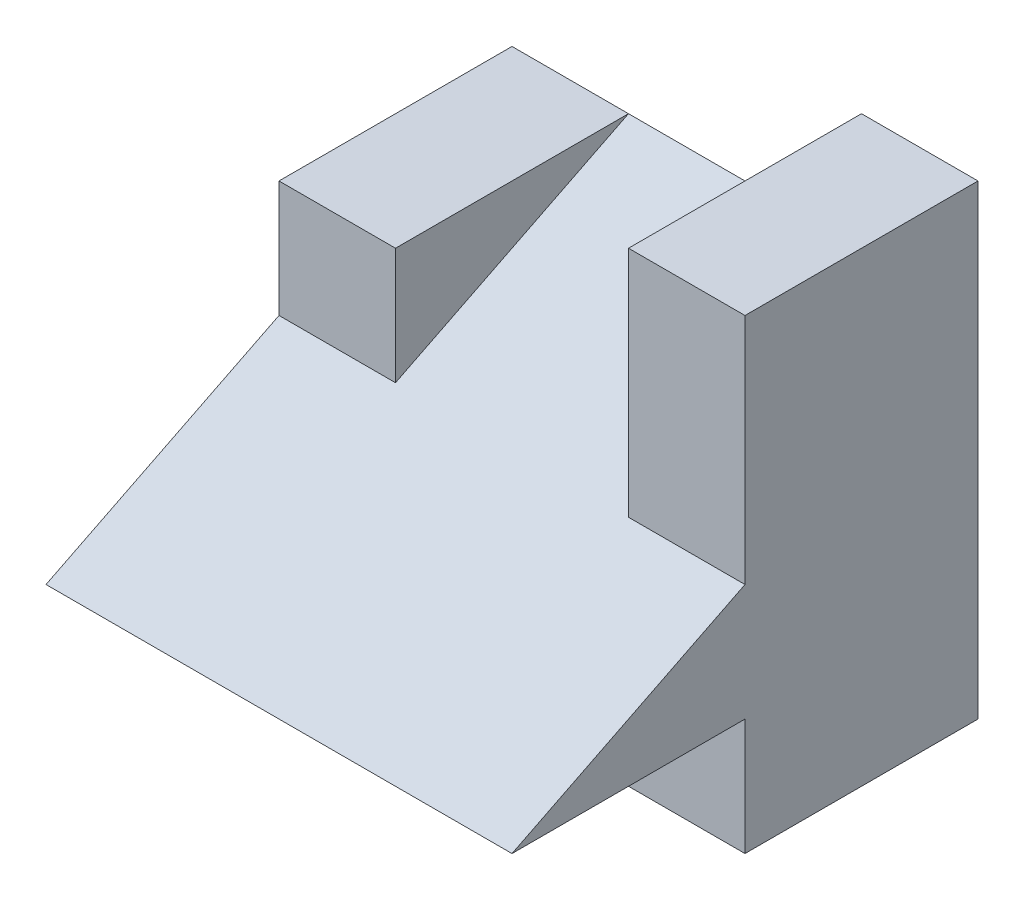
ISO-10303-21;
HEADER;
FILE_DESCRIPTION(('STEP AP214'),'2;1');
FILE_NAME('part.step','',(''),(''),'','','');
FILE_SCHEMA(('AUTOMOTIVE_DESIGN { 1 0 10303 214 1 1 1 1 }'));
ENDSEC;
DATA;
#1=APPLICATION_CONTEXT('core data for automotive mechanical design processes');
#2=APPLICATION_PROTOCOL_DEFINITION('international standard','automotive_design',2000,#1);
#3=PRODUCT_CONTEXT('',#1,'mechanical');
#4=PRODUCT('Part','Part','',(#3));
#5=PRODUCT_RELATED_PRODUCT_CATEGORY('part','',(#4));
#6=PRODUCT_DEFINITION_FORMATION('','',#4);
#7=PRODUCT_DEFINITION_CONTEXT('part definition',#1,'design');
#8=PRODUCT_DEFINITION('design','',#6,#7);
#9=PRODUCT_DEFINITION_SHAPE('','',#8);
#10=(LENGTH_UNIT() NAMED_UNIT(*) SI_UNIT(.MILLI.,.METRE.));
#11=(NAMED_UNIT(*) PLANE_ANGLE_UNIT() SI_UNIT($,.RADIAN.));
#12=(NAMED_UNIT(*) SI_UNIT($,.STERADIAN.) SOLID_ANGLE_UNIT());
#13=UNCERTAINTY_MEASURE_WITH_UNIT(LENGTH_MEASURE(1.E-05),#10,'distance_accuracy_value','');
#14=(GEOMETRIC_REPRESENTATION_CONTEXT(3) GLOBAL_UNCERTAINTY_ASSIGNED_CONTEXT((#13)) GLOBAL_UNIT_ASSIGNED_CONTEXT((#10,
#11,#12)) REPRESENTATION_CONTEXT('',''));
#15=CARTESIAN_POINT('',(0.,0.,0.));
#16=DIRECTION('',(0.,0.,1.));
#17=DIRECTION('',(1.,0.,0.));
#18=AXIS2_PLACEMENT_3D('',#15,#16,#17);
#19=CARTESIAN_POINT('',(12.,0.,0.));
#20=DIRECTION('',(0.,0.,-1.));
#21=DIRECTION('',(-1.,0.,0.));
#22=AXIS2_PLACEMENT_3D('',#19,#20,#21);
#23=PLANE('',#22);
#24=DIRECTION('',(0.,1.,0.));
#25=VECTOR('',#24,1.);
#26=CARTESIAN_POINT('',(-1.,2.,0.));
#27=LINE('',#26,#25);
#28=CARTESIAN_POINT('',(-1.,2.,0.));
#29=VERTEX_POINT('',#28);
#30=CARTESIAN_POINT('',(-1.,3.,0.));
#31=VERTEX_POINT('',#30);
#32=EDGE_CURVE('E134',#29,#31,#27,.T.);
#33=ORIENTED_EDGE('',*,*,#32,.T.);
#34=DIRECTION('',(-1.,0.,0.));
#35=VECTOR('',#34,1.);
#36=CARTESIAN_POINT('',(1.,3.,0.));
#37=LINE('',#36,#35);
#38=CARTESIAN_POINT('',(-2.,3.,0.));
#39=VERTEX_POINT('',#38);
#40=EDGE_CURVE('E146',#31,#39,#37,.T.);
#41=ORIENTED_EDGE('',*,*,#40,.T.);
#42=DIRECTION('',(0.,-1.,0.));
#43=VECTOR('',#42,1.);
#44=CARTESIAN_POINT('',(-2.,0.,0.));
#45=LINE('',#44,#43);
#46=CARTESIAN_POINT('',(-2.,2.,0.));
#47=VERTEX_POINT('',#46);
#48=EDGE_CURVE('E176',#39,#47,#45,.T.);
#49=ORIENTED_EDGE('',*,*,#48,.T.);
#50=DIRECTION('',(-1.,0.,0.));
#51=VECTOR('',#50,1.);
#52=CARTESIAN_POINT('',(12.,2.,0.));
#53=LINE('',#52,#51);
#54=EDGE_CURVE('E182',#29,#47,#53,.T.);
#55=ORIENTED_EDGE('',*,*,#54,.F.);
#56=EDGE_LOOP('',(#33,#41,#49,#55));
#57=FACE_BOUND('',#56,.T.);
#58=ADVANCED_FACE('F33',(#57),#23,.F.);
#59=CARTESIAN_POINT('',(1.,3.,-2.));
#60=DIRECTION('',(0.,-1.,0.));
#61=DIRECTION('',(0.,0.,-1.));
#62=AXIS2_PLACEMENT_3D('',#59,#60,#61);
#63=PLANE('',#62);
#64=DIRECTION('',(0.,0.,-1.));
#65=VECTOR('',#64,1.);
#66=CARTESIAN_POINT('',(-1.,3.,0.));
#67=LINE('',#66,#65);
#68=CARTESIAN_POINT('',(-1.,3.,-2.));
#69=VERTEX_POINT('',#68);
#70=EDGE_CURVE('E132',#31,#69,#67,.T.);
#71=ORIENTED_EDGE('',*,*,#70,.T.);
#72=DIRECTION('',(-1.,0.,0.));
#73=VECTOR('',#72,1.);
#74=CARTESIAN_POINT('',(1.,3.,-2.));
#75=LINE('',#74,#73);
#76=CARTESIAN_POINT('',(-2.,3.,-2.));
#77=VERTEX_POINT('',#76);
#78=EDGE_CURVE('E147',#69,#77,#75,.T.);
#79=ORIENTED_EDGE('',*,*,#78,.T.);
#80=DIRECTION('',(0.,0.,1.));
#81=VECTOR('',#80,1.);
#82=CARTESIAN_POINT('',(-2.,3.,-2.));
#83=LINE('',#82,#81);
#84=EDGE_CURVE('E213',#77,#39,#83,.T.);
#85=ORIENTED_EDGE('',*,*,#84,.T.);
#86=ORIENTED_EDGE('',*,*,#40,.F.);
#87=EDGE_LOOP('',(#71,#79,#85,#86));
#88=FACE_BOUND('',#87,.T.);
#89=ADVANCED_FACE('F151',(#88),#63,.F.);
#90=CARTESIAN_POINT('',(0.,4.,0.));
#91=DIRECTION('',(0.,-1.,0.));
#92=DIRECTION('',(0.,0.,-1.));
#93=AXIS2_PLACEMENT_3D('',#90,#91,#92);
#94=PLANE('',#93);
#95=DIRECTION('',(0.,0.,-1.));
#96=VECTOR('',#95,1.);
#97=CARTESIAN_POINT('',(1.,4.,-2.));
#98=LINE('',#97,#96);
#99=CARTESIAN_POINT('',(1.,4.,0.));
#100=VERTEX_POINT('',#99);
#101=CARTESIAN_POINT('',(1.,4.,-2.));
#102=VERTEX_POINT('',#101);
#103=EDGE_CURVE('E159',#100,#102,#98,.T.);
#104=ORIENTED_EDGE('',*,*,#103,.F.);
#105=DIRECTION('',(1.,0.,0.));
#106=VECTOR('',#105,1.);
#107=CARTESIAN_POINT('',(0.,4.,0.));
#108=LINE('',#107,#106);
#109=CARTESIAN_POINT('',(2.,4.,0.));
#110=VERTEX_POINT('',#109);
#111=EDGE_CURVE('E41',#100,#110,#108,.T.);
#112=ORIENTED_EDGE('',*,*,#111,.T.);
#113=DIRECTION('',(0.,0.,-1.));
#114=VECTOR('',#113,1.);
#115=CARTESIAN_POINT('',(2.,4.,2.));
#116=LINE('',#115,#114);
#117=CARTESIAN_POINT('',(2.,4.,-2.));
#118=VERTEX_POINT('',#117);
#119=EDGE_CURVE('E53',#110,#118,#116,.T.);
#120=ORIENTED_EDGE('',*,*,#119,.T.);
#121=DIRECTION('',(-1.,0.,0.));
#122=VECTOR('',#121,1.);
#123=CARTESIAN_POINT('',(-2.,4.,-2.));
#124=LINE('',#123,#122);
#125=EDGE_CURVE('E192',#118,#102,#124,.T.);
#126=ORIENTED_EDGE('',*,*,#125,.T.);
#127=EDGE_LOOP('',(#104,#112,#120,#126));
#128=FACE_BOUND('',#127,.T.);
#129=ADVANCED_FACE('F238',(#128),#94,.F.);
#130=CARTESIAN_POINT('',(2.,4.,2.));
#131=DIRECTION('',(-1.,0.,0.));
#132=DIRECTION('',(0.,0.,1.));
#133=AXIS2_PLACEMENT_3D('',#130,#131,#132);
#134=PLANE('',#133);
#135=DIRECTION('',(0.,1.,0.));
#136=VECTOR('',#135,1.);
#137=CARTESIAN_POINT('',(2.,4.,0.));
#138=LINE('',#137,#136);
#139=CARTESIAN_POINT('',(2.,0.,0.));
#140=VERTEX_POINT('',#139);
#141=CARTESIAN_POINT('',(2.,1.,0.));
#142=VERTEX_POINT('',#141);
#143=EDGE_CURVE('E174',#140,#142,#138,.T.);
#144=ORIENTED_EDGE('',*,*,#143,.F.);
#145=DIRECTION('',(0.,0.,-1.));
#146=VECTOR('',#145,1.);
#147=CARTESIAN_POINT('',(2.,0.,2.));
#148=LINE('',#147,#146);
#149=CARTESIAN_POINT('',(2.,0.,-2.));
#150=VERTEX_POINT('',#149);
#151=EDGE_CURVE('E66',#140,#150,#148,.T.);
#152=ORIENTED_EDGE('',*,*,#151,.T.);
#153=DIRECTION('',(0.,-1.,0.));
#154=VECTOR('',#153,1.);
#155=CARTESIAN_POINT('',(2.,4.,-2.));
#156=LINE('',#155,#154);
#157=EDGE_CURVE('E201',#118,#150,#156,.T.);
#158=ORIENTED_EDGE('',*,*,#157,.F.);
#159=ORIENTED_EDGE('',*,*,#119,.F.);
#160=DIRECTION('',(0.,-1.,0.));
#161=VECTOR('',#160,1.);
#162=CARTESIAN_POINT('',(2.,4.,0.));
#163=LINE('',#162,#161);
#164=CARTESIAN_POINT('',(2.,2.,0.));
#165=VERTEX_POINT('',#164);
#166=EDGE_CURVE('E185',#110,#165,#163,.T.);
#167=ORIENTED_EDGE('',*,*,#166,.T.);
#168=DIRECTION('',(0.,-0.447213595499958,0.894427190999916));
#169=VECTOR('',#168,1.);
#170=CARTESIAN_POINT('',(2.,1.6,0.8));
#171=LINE('',#170,#169);
#172=CARTESIAN_POINT('',(2.,1.,2.));
#173=VERTEX_POINT('',#172);
#174=EDGE_CURVE('E81',#165,#173,#171,.T.);
#175=ORIENTED_EDGE('',*,*,#174,.T.);
#176=DIRECTION('',(0.,0.,-1.));
#177=VECTOR('',#176,1.);
#178=CARTESIAN_POINT('',(2.,1.,2.));
#179=LINE('',#178,#177);
#180=EDGE_CURVE('E74',#173,#142,#179,.T.);
#181=ORIENTED_EDGE('',*,*,#180,.T.);
#182=EDGE_LOOP('',(#144,#152,#158,#159,#167,#175,#181));
#183=FACE_BOUND('',#182,.T.);
#184=ADVANCED_FACE('F35',(#183),#134,.F.);
#185=CARTESIAN_POINT('',(-2.,4.,2.));
#186=DIRECTION('',(1.,0.,0.));
#187=DIRECTION('',(0.,0.,-1.));
#188=AXIS2_PLACEMENT_3D('',#185,#186,#187);
#189=PLANE('',#188);
#190=ORIENTED_EDGE('',*,*,#48,.F.);
#191=ORIENTED_EDGE('',*,*,#84,.F.);
#192=DIRECTION('',(0.,-1.,0.));
#193=VECTOR('',#192,1.);
#194=CARTESIAN_POINT('',(-2.,4.,-2.));
#195=LINE('',#194,#193);
#196=CARTESIAN_POINT('',(-2.,0.,-2.));
#197=VERTEX_POINT('',#196);
#198=EDGE_CURVE('E158',#77,#197,#195,.T.);
#199=ORIENTED_EDGE('',*,*,#198,.T.);
#200=DIRECTION('',(0.,0.,1.));
#201=VECTOR('',#200,1.);
#202=CARTESIAN_POINT('',(-2.,0.,2.));
#203=LINE('',#202,#201);
#204=CARTESIAN_POINT('',(-2.,0.,0.));
#205=VERTEX_POINT('',#204);
#206=EDGE_CURVE('E193',#197,#205,#203,.T.);
#207=ORIENTED_EDGE('',*,*,#206,.T.);
#208=DIRECTION('',(0.,1.,0.));
#209=VECTOR('',#208,1.);
#210=CARTESIAN_POINT('',(-2.,0.,0.));
#211=LINE('',#210,#209);
#212=CARTESIAN_POINT('',(-2.,1.,0.));
#213=VERTEX_POINT('',#212);
#214=EDGE_CURVE('E168',#205,#213,#211,.T.);
#215=ORIENTED_EDGE('',*,*,#214,.T.);
#216=DIRECTION('',(0.,0.,-1.));
#217=VECTOR('',#216,1.);
#218=CARTESIAN_POINT('',(-2.,1.,0.));
#219=LINE('',#218,#217);
#220=CARTESIAN_POINT('',(-2.,1.,2.));
#221=VERTEX_POINT('',#220);
#222=EDGE_CURVE('E167',#221,#213,#219,.T.);
#223=ORIENTED_EDGE('',*,*,#222,.F.);
#224=DIRECTION('',(0.,-0.447213595499958,0.894427190999916));
#225=VECTOR('',#224,1.);
#226=CARTESIAN_POINT('',(-2.,1.6,0.8));
#227=LINE('',#226,#225);
#228=EDGE_CURVE('E179',#47,#221,#227,.T.);
#229=ORIENTED_EDGE('',*,*,#228,.F.);
#230=EDGE_LOOP('',(#190,#191,#199,#207,#215,#223,#229));
#231=FACE_BOUND('',#230,.T.);
#232=ADVANCED_FACE('F219',(#231),#189,.F.);
#233=CARTESIAN_POINT('',(0.,0.,0.));
#234=DIRECTION('',(0.,-1.,0.));
#235=DIRECTION('',(0.,0.,-1.));
#236=AXIS2_PLACEMENT_3D('',#233,#234,#235);
#237=PLANE('',#236);
#238=ORIENTED_EDGE('',*,*,#151,.F.);
#239=DIRECTION('',(-1.,0.,0.));
#240=VECTOR('',#239,1.);
#241=CARTESIAN_POINT('',(0.,0.,0.));
#242=LINE('',#241,#240);
#243=EDGE_CURVE('E11',#140,#205,#242,.T.);
#244=ORIENTED_EDGE('',*,*,#243,.T.);
#245=ORIENTED_EDGE('',*,*,#206,.F.);
#246=DIRECTION('',(-1.,0.,0.));
#247=VECTOR('',#246,1.);
#248=CARTESIAN_POINT('',(-2.,0.,-2.));
#249=LINE('',#248,#247);
#250=EDGE_CURVE('E196',#150,#197,#249,.T.);
#251=ORIENTED_EDGE('',*,*,#250,.F.);
#252=EDGE_LOOP('',(#238,#244,#245,#251));
#253=FACE_BOUND('',#252,.T.);
#254=ADVANCED_FACE('F223',(#253),#237,.T.);
#255=CARTESIAN_POINT('',(-2.,4.,-2.));
#256=DIRECTION('',(0.,0.,1.));
#257=DIRECTION('',(1.,0.,0.));
#258=AXIS2_PLACEMENT_3D('',#255,#256,#257);
#259=PLANE('',#258);
#260=ORIENTED_EDGE('',*,*,#198,.F.);
#261=ORIENTED_EDGE('',*,*,#78,.F.);
#262=CARTESIAN_POINT('',(1.,3.,-2.));
#263=VERTEX_POINT('',#262);
#264=EDGE_CURVE('E138',#263,#69,#75,.T.);
#265=ORIENTED_EDGE('',*,*,#264,.F.);
#266=DIRECTION('',(0.,-1.,0.));
#267=VECTOR('',#266,1.);
#268=CARTESIAN_POINT('',(1.,4.,-2.));
#269=LINE('',#268,#267);
#270=EDGE_CURVE('E207',#102,#263,#269,.T.);
#271=ORIENTED_EDGE('',*,*,#270,.F.);
#272=ORIENTED_EDGE('',*,*,#125,.F.);
#273=ORIENTED_EDGE('',*,*,#157,.T.);
#274=ORIENTED_EDGE('',*,*,#250,.T.);
#275=EDGE_LOOP('',(#260,#261,#265,#271,#272,#273,#274));
#276=FACE_BOUND('',#275,.T.);
#277=ADVANCED_FACE('F156',(#276),#259,.F.);
#278=CARTESIAN_POINT('',(12.,1.6,0.8));
#279=DIRECTION('',(0.,-0.894427190999916,-0.447213595499958));
#280=DIRECTION('',(0.,0.447213595499958,-0.894427190999916));
#281=AXIS2_PLACEMENT_3D('',#278,#279,#280);
#282=PLANE('',#281);
#283=CARTESIAN_POINT('',(1.,2.,0.));
#284=VERTEX_POINT('',#283);
#285=EDGE_CURVE('E186',#165,#284,#53,.T.);
#286=ORIENTED_EDGE('',*,*,#285,.T.);
#287=DIRECTION('',(0.,-0.447213595499958,0.894427190999916));
#288=VECTOR('',#287,1.);
#289=CARTESIAN_POINT('',(1.,3.,-2.));
#290=LINE('',#289,#288);
#291=EDGE_CURVE('E141',#263,#284,#290,.T.);
#292=ORIENTED_EDGE('',*,*,#291,.F.);
#293=ORIENTED_EDGE('',*,*,#264,.T.);
#294=DIRECTION('',(0.,-0.447213595499958,0.894427190999916));
#295=VECTOR('',#294,1.);
#296=CARTESIAN_POINT('',(-1.,3.,-2.));
#297=LINE('',#296,#295);
#298=EDGE_CURVE('E128',#69,#29,#297,.T.);
#299=ORIENTED_EDGE('',*,*,#298,.T.);
#300=ORIENTED_EDGE('',*,*,#54,.T.);
#301=ORIENTED_EDGE('',*,*,#228,.T.);
#302=DIRECTION('',(-1.,0.,0.));
#303=VECTOR('',#302,1.);
#304=CARTESIAN_POINT('',(12.,1.,2.));
#305=LINE('',#304,#303);
#306=EDGE_CURVE('E183',#173,#221,#305,.T.);
#307=ORIENTED_EDGE('',*,*,#306,.F.);
#308=ORIENTED_EDGE('',*,*,#174,.F.);
#309=EDGE_LOOP('',(#286,#292,#293,#299,#300,#301,#307,#308));
#310=FACE_BOUND('',#309,.T.);
#311=ADVANCED_FACE('F139',(#310),#282,.F.);
#312=DIRECTION('',(0.,1.,0.));
#313=VECTOR('',#312,1.);
#314=CARTESIAN_POINT('',(1.,4.,0.));
#315=LINE('',#314,#313);
#316=EDGE_CURVE('E160',#284,#100,#315,.T.);
#317=ORIENTED_EDGE('',*,*,#316,.F.);
#318=ORIENTED_EDGE('',*,*,#285,.F.);
#319=ORIENTED_EDGE('',*,*,#166,.F.);
#320=ORIENTED_EDGE('',*,*,#111,.F.);
#321=EDGE_LOOP('',(#317,#318,#319,#320));
#322=FACE_BOUND('',#321,.T.);
#323=ADVANCED_FACE('F205',(#322),#23,.F.);
#324=CARTESIAN_POINT('',(12.,0.,0.));
#325=DIRECTION('',(0.,0.,1.));
#326=DIRECTION('',(1.,0.,0.));
#327=AXIS2_PLACEMENT_3D('',#324,#325,#326);
#328=PLANE('',#327);
#329=ORIENTED_EDGE('',*,*,#143,.T.);
#330=DIRECTION('',(-1.,0.,0.));
#331=VECTOR('',#330,1.);
#332=CARTESIAN_POINT('',(12.,1.,0.));
#333=LINE('',#332,#331);
#334=EDGE_CURVE('E165',#142,#213,#333,.T.);
#335=ORIENTED_EDGE('',*,*,#334,.T.);
#336=ORIENTED_EDGE('',*,*,#214,.F.);
#337=ORIENTED_EDGE('',*,*,#243,.F.);
#338=EDGE_LOOP('',(#329,#335,#336,#337));
#339=FACE_BOUND('',#338,.T.);
#340=ADVANCED_FACE('F224',(#339),#328,.T.);
#341=CARTESIAN_POINT('',(12.,1.,0.));
#342=DIRECTION('',(0.,1.,0.));
#343=DIRECTION('',(0.,0.,1.));
#344=AXIS2_PLACEMENT_3D('',#341,#342,#343);
#345=PLANE('',#344);
#346=ORIENTED_EDGE('',*,*,#306,.T.);
#347=ORIENTED_EDGE('',*,*,#222,.T.);
#348=ORIENTED_EDGE('',*,*,#334,.F.);
#349=ORIENTED_EDGE('',*,*,#180,.F.);
#350=EDGE_LOOP('',(#346,#347,#348,#349));
#351=FACE_BOUND('',#350,.T.);
#352=ADVANCED_FACE('F220',(#351),#345,.F.);
#353=CARTESIAN_POINT('',(1.,0.,0.));
#354=DIRECTION('',(-1.,0.,0.));
#355=DIRECTION('',(0.,0.,1.));
#356=AXIS2_PLACEMENT_3D('',#353,#354,#355);
#357=PLANE('',#356);
#358=ORIENTED_EDGE('',*,*,#270,.T.);
#359=ORIENTED_EDGE('',*,*,#291,.T.);
#360=ORIENTED_EDGE('',*,*,#316,.T.);
#361=ORIENTED_EDGE('',*,*,#103,.T.);
#362=EDGE_LOOP('',(#358,#359,#360,#361));
#363=FACE_BOUND('',#362,.T.);
#364=ADVANCED_FACE('F209',(#363),#357,.T.);
#365=CARTESIAN_POINT('',(-1.,0.,0.));
#366=DIRECTION('',(1.,0.,0.));
#367=DIRECTION('',(0.,0.,-1.));
#368=AXIS2_PLACEMENT_3D('',#365,#366,#367);
#369=PLANE('',#368);
#370=ORIENTED_EDGE('',*,*,#70,.F.);
#371=ORIENTED_EDGE('',*,*,#32,.F.);
#372=ORIENTED_EDGE('',*,*,#298,.F.);
#373=EDGE_LOOP('',(#370,#371,#372));
#374=FACE_BOUND('',#373,.T.);
#375=ADVANCED_FACE('F130',(#374),#369,.T.);
#376=CLOSED_SHELL('',(#58,#89,#129,#184,#232,#254,#277,#311,#323,#340,#352,#364,#375));
#377=MANIFOLD_SOLID_BREP('B2',#376);
#378=ADVANCED_BREP_SHAPE_REPRESENTATION('',(#18,#377),#14);
#379=SHAPE_DEFINITION_REPRESENTATION(#9,#378);
ENDSEC;
END-ISO-10303-21;
